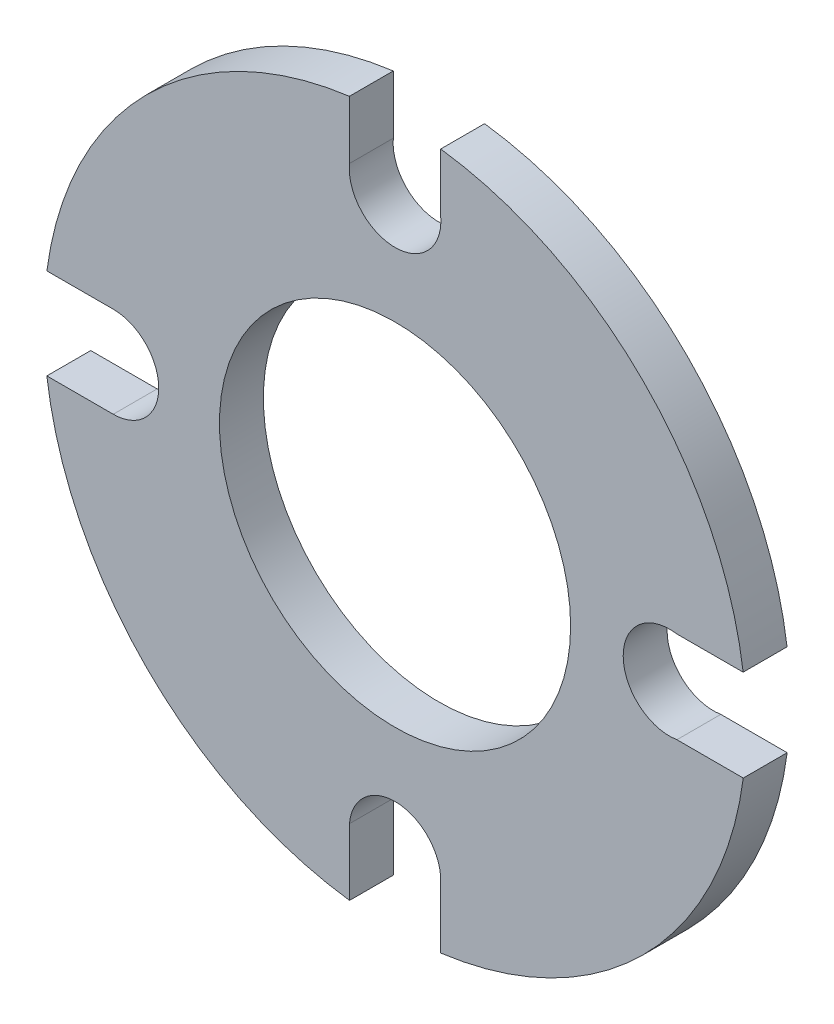
ISO-10303-21;
HEADER;
FILE_DESCRIPTION(('STEP AP214'),'2;1');
FILE_NAME('part.step','',(''),(''),'','','');
FILE_SCHEMA(('AUTOMOTIVE_DESIGN { 1 0 10303 214 1 1 1 1 }'));
ENDSEC;
DATA;
#1=APPLICATION_CONTEXT('core data for automotive mechanical design processes');
#2=APPLICATION_PROTOCOL_DEFINITION('international standard','automotive_design',2000,#1);
#3=PRODUCT_CONTEXT('',#1,'mechanical');
#4=PRODUCT('Part','Part','',(#3));
#5=PRODUCT_RELATED_PRODUCT_CATEGORY('part','',(#4));
#6=PRODUCT_DEFINITION_FORMATION('','',#4);
#7=PRODUCT_DEFINITION_CONTEXT('part definition',#1,'design');
#8=PRODUCT_DEFINITION('design','',#6,#7);
#9=PRODUCT_DEFINITION_SHAPE('','',#8);
#10=(LENGTH_UNIT() NAMED_UNIT(*) SI_UNIT(.MILLI.,.METRE.));
#11=(NAMED_UNIT(*) PLANE_ANGLE_UNIT() SI_UNIT($,.RADIAN.));
#12=(NAMED_UNIT(*) SI_UNIT($,.STERADIAN.) SOLID_ANGLE_UNIT());
#13=UNCERTAINTY_MEASURE_WITH_UNIT(LENGTH_MEASURE(1.E-05),#10,'distance_accuracy_value','');
#14=(GEOMETRIC_REPRESENTATION_CONTEXT(3) GLOBAL_UNCERTAINTY_ASSIGNED_CONTEXT((#13)) GLOBAL_UNIT_ASSIGNED_CONTEXT((#10,
#11,#12)) REPRESENTATION_CONTEXT('',''));
#15=CARTESIAN_POINT('',(0.,0.,0.));
#16=DIRECTION('',(0.,0.,1.));
#17=DIRECTION('',(1.,0.,0.));
#18=AXIS2_PLACEMENT_3D('',#15,#16,#17);
#19=CARTESIAN_POINT('',(-0.000815169605640896,-12.8964706457342,12.5));
#20=DIRECTION('',(6.32087356614961E-05,0.999999998002328,0.));
#21=DIRECTION('',(-0.999999998002328,6.32087356614961E-05,0.));
#22=AXIS2_PLACEMENT_3D('',#19,#20,#21);
#23=PLANE('',#22);
#24=DIRECTION('',(0.999999998002328,-6.32087356614961E-05,0.));
#25=VECTOR('',#24,1.);
#26=CARTESIAN_POINT('',(-0.000815169605640896,-12.8964706457342,0.));
#27=LINE('',#26,#25);
#28=CARTESIAN_POINT('',(-99.1657333863333,-12.8902025566192,0.));
#29=VERTEX_POINT('',#28);
#30=CARTESIAN_POINT('',(-80.2527401256116,-12.8913980230132,0.));
#31=VERTEX_POINT('',#30);
#32=EDGE_CURVE('E225',#29,#31,#27,.T.);
#33=ORIENTED_EDGE('',*,*,#32,.F.);
#34=DIRECTION('',(0.,0.,-1.));
#35=VECTOR('',#34,1.);
#36=CARTESIAN_POINT('',(-99.1657333863333,-12.8902025566192,12.5));
#37=LINE('',#36,#35);
#38=CARTESIAN_POINT('',(-99.1657333863333,-12.8902025566192,12.5));
#39=VERTEX_POINT('',#38);
#40=EDGE_CURVE('E11',#39,#29,#37,.T.);
#41=ORIENTED_EDGE('',*,*,#40,.F.);
#42=DIRECTION('',(0.999999998002328,-6.32087356614961E-05,0.));
#43=VECTOR('',#42,1.);
#44=CARTESIAN_POINT('',(-0.000815169605640896,-12.8964706457342,12.5));
#45=LINE('',#44,#43);
#46=CARTESIAN_POINT('',(-80.2527401256116,-12.8913980230132,12.5));
#47=VERTEX_POINT('',#46);
#48=EDGE_CURVE('E485',#39,#47,#45,.T.);
#49=ORIENTED_EDGE('',*,*,#48,.T.);
#50=DIRECTION('',(0.,0.,-1.));
#51=VECTOR('',#50,1.);
#52=CARTESIAN_POINT('',(-80.2527401256116,-12.8913980230132,12.5));
#53=LINE('',#52,#51);
#54=EDGE_CURVE('E60',#47,#31,#53,.T.);
#55=ORIENTED_EDGE('',*,*,#54,.T.);
#56=EDGE_LOOP('',(#33,#41,#49,#55));
#57=FACE_BOUND('',#56,.T.);
#58=ADVANCED_FACE('F43',(#57),#23,.T.);
#59=CARTESIAN_POINT('',(0.,0.,12.5));
#60=DIRECTION('',(0.,0.,-1.));
#61=DIRECTION('',(-1.,0.,0.));
#62=AXIS2_PLACEMENT_3D('',#59,#60,#61);
#63=CYLINDRICAL_SURFACE('',#62,100.);
#64=CARTESIAN_POINT('',(0.,0.,0.));
#65=DIRECTION('',(0.,0.,1.));
#66=DIRECTION('',(1.,0.,0.));
#67=AXIS2_PLACEMENT_3D('',#64,#65,#66);
#68=CIRCLE('',#67,100.);
#69=CARTESIAN_POINT('',(-12.9649431505709,-99.1559894766951,0.));
#70=VERTEX_POINT('',#69);
#71=EDGE_CURVE('E222',#29,#70,#68,.T.);
#72=ORIENTED_EDGE('',*,*,#71,.T.);
#73=DIRECTION('',(0.,0.,-1.));
#74=VECTOR('',#73,1.);
#75=CARTESIAN_POINT('',(-12.9649431505709,-99.1559894766951,12.5));
#76=LINE('',#75,#74);
#77=CARTESIAN_POINT('',(-12.9649431505709,-99.1559894766951,12.5));
#78=VERTEX_POINT('',#77);
#79=EDGE_CURVE('E52',#78,#70,#76,.T.);
#80=ORIENTED_EDGE('',*,*,#79,.F.);
#81=CARTESIAN_POINT('',(0.,0.,12.5));
#82=DIRECTION('',(0.,0.,1.));
#83=DIRECTION('',(1.,0.,0.));
#84=AXIS2_PLACEMENT_3D('',#81,#82,#83);
#85=CIRCLE('',#84,100.);
#86=EDGE_CURVE('E481',#39,#78,#85,.T.);
#87=ORIENTED_EDGE('',*,*,#86,.F.);
#88=ORIENTED_EDGE('',*,*,#40,.T.);
#89=EDGE_LOOP('',(#72,#80,#87,#88));
#90=FACE_BOUND('',#89,.T.);
#91=ADVANCED_FACE('F223',(#90),#63,.T.);
#92=CARTESIAN_POINT('',(-13.0665946672208,-0.0133972608107675,12.5));
#93=DIRECTION('',(0.99999947437399,0.00102530568292804,0.));
#94=DIRECTION('',(-0.00102530568292804,0.99999947437399,0.));
#95=AXIS2_PLACEMENT_3D('',#92,#93,#94);
#96=PLANE('',#95);
#97=DIRECTION('',(0.00102530568292804,-0.99999947437399,0.));
#98=VECTOR('',#97,1.);
#99=CARTESIAN_POINT('',(-13.0665946672208,-0.0133972608107675,0.));
#100=LINE('',#99,#98);
#101=CARTESIAN_POINT('',(-12.9843401339299,-80.2377551526905,0.));
#102=VERTEX_POINT('',#101);
#103=EDGE_CURVE('E216',#102,#70,#100,.T.);
#104=ORIENTED_EDGE('',*,*,#103,.F.);
#105=DIRECTION('',(0.,0.,-1.));
#106=VECTOR('',#105,1.);
#107=CARTESIAN_POINT('',(-12.9843401339299,-80.2377551526905,12.5));
#108=LINE('',#107,#106);
#109=CARTESIAN_POINT('',(-12.9843401339299,-80.2377551526905,12.5));
#110=VERTEX_POINT('',#109);
#111=EDGE_CURVE('E208',#110,#102,#108,.T.);
#112=ORIENTED_EDGE('',*,*,#111,.F.);
#113=DIRECTION('',(0.00102530568292804,-0.99999947437399,0.));
#114=VECTOR('',#113,1.);
#115=CARTESIAN_POINT('',(-13.0665946672208,-0.0133972608107675,12.5));
#116=LINE('',#115,#114);
#117=EDGE_CURVE('E219',#110,#78,#116,.T.);
#118=ORIENTED_EDGE('',*,*,#117,.T.);
#119=ORIENTED_EDGE('',*,*,#79,.T.);
#120=EDGE_LOOP('',(#104,#112,#118,#119));
#121=FACE_BOUND('',#120,.T.);
#122=ADVANCED_FACE('F214',(#121),#96,.T.);
#123=CARTESIAN_POINT('',(0.,-81.3,12.5));
#124=DIRECTION('',(0.,0.,-1.));
#125=DIRECTION('',(-1.,0.,0.));
#126=AXIS2_PLACEMENT_3D('',#123,#124,#125);
#127=CYLINDRICAL_SURFACE('',#126,13.0277186348653);
#128=CARTESIAN_POINT('',(0.,-81.3,0.));
#129=DIRECTION('',(0.,0.,1.));
#130=DIRECTION('',(1.,0.,0.));
#131=AXIS2_PLACEMENT_3D('',#128,#129,#130);
#132=CIRCLE('',#131,13.0277186348653);
#133=CARTESIAN_POINT('',(12.9858361253175,-80.2562026271266,0.));
#134=VERTEX_POINT('',#133);
#135=EDGE_CURVE('E230',#134,#102,#132,.T.);
#136=ORIENTED_EDGE('',*,*,#135,.F.);
#137=DIRECTION('',(0.,0.,-1.));
#138=VECTOR('',#137,1.);
#139=CARTESIAN_POINT('',(12.9858361253175,-80.2562026271266,12.5));
#140=LINE('',#139,#138);
#141=CARTESIAN_POINT('',(12.9858361253175,-80.2562026271266,12.5));
#142=VERTEX_POINT('',#141);
#143=EDGE_CURVE('E206',#142,#134,#140,.T.);
#144=ORIENTED_EDGE('',*,*,#143,.F.);
#145=CARTESIAN_POINT('',(0.,-81.3,12.5));
#146=DIRECTION('',(0.,0.,1.));
#147=DIRECTION('',(1.,0.,0.));
#148=AXIS2_PLACEMENT_3D('',#145,#146,#147);
#149=CIRCLE('',#148,13.0277186348653);
#150=EDGE_CURVE('E480',#142,#110,#149,.T.);
#151=ORIENTED_EDGE('',*,*,#150,.T.);
#152=ORIENTED_EDGE('',*,*,#111,.T.);
#153=EDGE_LOOP('',(#136,#144,#151,#152));
#154=FACE_BOUND('',#153,.T.);
#155=ADVANCED_FACE('F292',(#154),#127,.F.);
#156=CARTESIAN_POINT('',(12.9921721125097,-0.00102570624428404,12.5));
#157=DIRECTION('',(0.999999996883605,-7.89480182532311E-05,0.));
#158=DIRECTION('',(7.89480182532311E-05,0.999999996883605,0.));
#159=AXIS2_PLACEMENT_3D('',#156,#157,#158);
#160=PLANE('',#159);
#161=DIRECTION('',(-7.89480182532311E-05,-0.999999996883605,0.));
#162=VECTOR('',#161,1.);
#163=CARTESIAN_POINT('',(12.9921721125097,-0.00102570624428404,0.));
#164=LINE('',#163,#162);
#165=CARTESIAN_POINT('',(12.9843442250193,-99.1534507974695,0.));
#166=VERTEX_POINT('',#165);
#167=EDGE_CURVE('E232',#134,#166,#164,.T.);
#168=ORIENTED_EDGE('',*,*,#167,.T.);
#169=DIRECTION('',(0.,0.,-1.));
#170=VECTOR('',#169,1.);
#171=CARTESIAN_POINT('',(12.9843442250193,-99.1534507974695,12.5));
#172=LINE('',#171,#170);
#173=CARTESIAN_POINT('',(12.9843442250193,-99.1534507974695,12.5));
#174=VERTEX_POINT('',#173);
#175=EDGE_CURVE('E203',#174,#166,#172,.T.);
#176=ORIENTED_EDGE('',*,*,#175,.F.);
#177=DIRECTION('',(-7.89480182532311E-05,-0.999999996883605,0.));
#178=VECTOR('',#177,1.);
#179=CARTESIAN_POINT('',(12.9921721125097,-0.00102570624428404,12.5));
#180=LINE('',#179,#178);
#181=EDGE_CURVE('E483',#142,#174,#180,.T.);
#182=ORIENTED_EDGE('',*,*,#181,.F.);
#183=ORIENTED_EDGE('',*,*,#143,.T.);
#184=EDGE_LOOP('',(#168,#176,#182,#183));
#185=FACE_BOUND('',#184,.T.);
#186=ADVANCED_FACE('F295',(#185),#160,.F.);
#187=CARTESIAN_POINT('',(0.,0.,12.5));
#188=DIRECTION('',(0.,0.,-1.));
#189=DIRECTION('',(-1.,0.,0.));
#190=AXIS2_PLACEMENT_3D('',#187,#188,#189);
#191=CYLINDRICAL_SURFACE('',#190,100.);
#192=CARTESIAN_POINT('',(0.,0.,0.));
#193=DIRECTION('',(0.,0.,1.));
#194=DIRECTION('',(1.,0.,0.));
#195=AXIS2_PLACEMENT_3D('',#192,#193,#194);
#196=CIRCLE('',#195,100.);
#197=CARTESIAN_POINT('',(99.164103047122,-12.9027387348491,0.));
#198=VERTEX_POINT('',#197);
#199=EDGE_CURVE('E238',#166,#198,#196,.T.);
#200=ORIENTED_EDGE('',*,*,#199,.T.);
#201=DIRECTION('',(0.,0.,-1.));
#202=VECTOR('',#201,1.);
#203=CARTESIAN_POINT('',(99.164103047122,-12.9027387348491,12.5));
#204=LINE('',#203,#202);
#205=CARTESIAN_POINT('',(99.164103047122,-12.9027387348491,12.5));
#206=VERTEX_POINT('',#205);
#207=EDGE_CURVE('E201',#206,#198,#204,.T.);
#208=ORIENTED_EDGE('',*,*,#207,.F.);
#209=CARTESIAN_POINT('',(0.,0.,12.5));
#210=DIRECTION('',(0.,0.,1.));
#211=DIRECTION('',(1.,0.,0.));
#212=AXIS2_PLACEMENT_3D('',#209,#210,#211);
#213=CIRCLE('',#212,100.);
#214=EDGE_CURVE('E475',#174,#206,#213,.T.);
#215=ORIENTED_EDGE('',*,*,#214,.F.);
#216=ORIENTED_EDGE('',*,*,#175,.T.);
#217=EDGE_LOOP('',(#200,#208,#215,#216));
#218=FACE_BOUND('',#217,.T.);
#219=ADVANCED_FACE('F299',(#218),#191,.T.);
#220=CARTESIAN_POINT('',(-0.000815169605639287,-12.8964706457342,12.5));
#221=DIRECTION('',(6.32087356613713E-05,0.999999998002328,0.));
#222=DIRECTION('',(-0.999999998002328,6.32087356613713E-05,0.));
#223=AXIS2_PLACEMENT_3D('',#220,#221,#222);
#224=PLANE('',#223);
#225=DIRECTION('',(0.999999998002328,-6.32087356613713E-05,0.));
#226=VECTOR('',#225,1.);
#227=CARTESIAN_POINT('',(-0.000815169605639287,-12.8964706457342,0.));
#228=LINE('',#227,#226);
#229=CARTESIAN_POINT('',(80.269796005816,-12.9015444495875,0.));
#230=VERTEX_POINT('',#229);
#231=EDGE_CURVE('E241',#230,#198,#228,.T.);
#232=ORIENTED_EDGE('',*,*,#231,.F.);
#233=DIRECTION('',(0.,0.,-1.));
#234=VECTOR('',#233,1.);
#235=CARTESIAN_POINT('',(80.269796005816,-12.9015444495875,12.5));
#236=LINE('',#235,#234);
#237=CARTESIAN_POINT('',(80.269796005816,-12.9015444495875,12.5));
#238=VERTEX_POINT('',#237);
#239=EDGE_CURVE('E199',#238,#230,#236,.T.);
#240=ORIENTED_EDGE('',*,*,#239,.F.);
#241=DIRECTION('',(0.999999998002328,-6.32087356613713E-05,0.));
#242=VECTOR('',#241,1.);
#243=CARTESIAN_POINT('',(-0.000815169605639287,-12.8964706457342,12.5));
#244=LINE('',#243,#242);
#245=EDGE_CURVE('E473',#238,#206,#244,.T.);
#246=ORIENTED_EDGE('',*,*,#245,.T.);
#247=ORIENTED_EDGE('',*,*,#207,.T.);
#248=EDGE_LOOP('',(#232,#240,#246,#247));
#249=FACE_BOUND('',#248,.T.);
#250=ADVANCED_FACE('F303',(#249),#224,.T.);
#251=CARTESIAN_POINT('',(78.1669565961171,0.128201757810213,12.5));
#252=DIRECTION('',(0.,0.,-1.));
#253=DIRECTION('',(-1.,0.,0.));
#254=AXIS2_PLACEMENT_3D('',#251,#252,#253);
#255=CYLINDRICAL_SURFACE('',#254,13.1983415553689);
#256=CARTESIAN_POINT('',(78.1669565961171,0.128201757810213,0.));
#257=DIRECTION('',(0.,0.,1.));
#258=DIRECTION('',(1.,0.,0.));
#259=AXIS2_PLACEMENT_3D('',#256,#257,#258);
#260=CIRCLE('',#259,13.1983415553689);
#261=CARTESIAN_POINT('',(80.2270445902029,13.1647755894886,0.));
#262=VERTEX_POINT('',#261);
#263=EDGE_CURVE('E244',#262,#230,#260,.T.);
#264=ORIENTED_EDGE('',*,*,#263,.F.);
#265=DIRECTION('',(0.,0.,-1.));
#266=VECTOR('',#265,1.);
#267=CARTESIAN_POINT('',(80.2270445902029,13.1647755894886,12.5));
#268=LINE('',#267,#266);
#269=CARTESIAN_POINT('',(80.2270445902029,13.1647755894886,12.5));
#270=VERTEX_POINT('',#269);
#271=EDGE_CURVE('E197',#270,#262,#268,.T.);
#272=ORIENTED_EDGE('',*,*,#271,.F.);
#273=CARTESIAN_POINT('',(78.1669565961171,0.128201757810213,12.5));
#274=DIRECTION('',(0.,0.,1.));
#275=DIRECTION('',(1.,0.,0.));
#276=AXIS2_PLACEMENT_3D('',#273,#274,#275);
#277=CIRCLE('',#276,13.1983415553689);
#278=EDGE_CURVE('E468',#270,#238,#277,.T.);
#279=ORIENTED_EDGE('',*,*,#278,.T.);
#280=ORIENTED_EDGE('',*,*,#239,.T.);
#281=EDGE_LOOP('',(#264,#272,#279,#280));
#282=FACE_BOUND('',#281,.T.);
#283=ADVANCED_FACE('F307',(#282),#255,.F.);
#284=CARTESIAN_POINT('',(-0.0120289391300913,13.0910465005806,12.5));
#285=DIRECTION('',(-0.000918867261791298,0.999999577841389,0.));
#286=DIRECTION('',(-0.999999577841389,-0.000918867261791298,0.));
#287=AXIS2_PLACEMENT_3D('',#284,#285,#286);
#288=PLANE('',#287);
#289=DIRECTION('',(0.999999577841389,0.000918867261791298,0.));
#290=VECTOR('',#289,1.);
#291=CARTESIAN_POINT('',(-0.0120289391300913,13.0910465005806,0.));
#292=LINE('',#291,#290);
#293=CARTESIAN_POINT('',(99.127347992285,13.1821424668542,0.));
#294=VERTEX_POINT('',#293);
#295=EDGE_CURVE('E247',#262,#294,#292,.T.);
#296=ORIENTED_EDGE('',*,*,#295,.T.);
#297=DIRECTION('',(0.,0.,-1.));
#298=VECTOR('',#297,1.);
#299=CARTESIAN_POINT('',(99.127347992285,13.1821424668542,12.5));
#300=LINE('',#299,#298);
#301=CARTESIAN_POINT('',(99.127347992285,13.1821424668542,12.5));
#302=VERTEX_POINT('',#301);
#303=EDGE_CURVE('E194',#302,#294,#300,.T.);
#304=ORIENTED_EDGE('',*,*,#303,.F.);
#305=DIRECTION('',(0.999999577841389,0.000918867261791298,0.));
#306=VECTOR('',#305,1.);
#307=CARTESIAN_POINT('',(-0.0120289391300913,13.0910465005806,12.5));
#308=LINE('',#307,#306);
#309=EDGE_CURVE('E465',#270,#302,#308,.T.);
#310=ORIENTED_EDGE('',*,*,#309,.F.);
#311=ORIENTED_EDGE('',*,*,#271,.T.);
#312=EDGE_LOOP('',(#296,#304,#310,#311));
#313=FACE_BOUND('',#312,.T.);
#314=ADVANCED_FACE('F311',(#313),#288,.F.);
#315=CARTESIAN_POINT('',(0.,0.,12.5));
#316=DIRECTION('',(0.,0.,-1.));
#317=DIRECTION('',(-1.,0.,0.));
#318=AXIS2_PLACEMENT_3D('',#315,#316,#317);
#319=CYLINDRICAL_SURFACE('',#318,100.);
#320=CARTESIAN_POINT('',(0.,0.,0.));
#321=DIRECTION('',(0.,0.,1.));
#322=DIRECTION('',(1.,0.,0.));
#323=AXIS2_PLACEMENT_3D('',#320,#321,#322);
#324=CIRCLE('',#323,100.);
#325=CARTESIAN_POINT('',(13.,99.1513993849809,0.));
#326=VERTEX_POINT('',#325);
#327=EDGE_CURVE('E250',#294,#326,#324,.T.);
#328=ORIENTED_EDGE('',*,*,#327,.T.);
#329=DIRECTION('',(0.,0.,-1.));
#330=VECTOR('',#329,1.);
#331=CARTESIAN_POINT('',(13.,99.1513993849809,12.5));
#332=LINE('',#331,#330);
#333=CARTESIAN_POINT('',(13.,99.1513993849809,12.5));
#334=VERTEX_POINT('',#333);
#335=EDGE_CURVE('E191',#334,#326,#332,.T.);
#336=ORIENTED_EDGE('',*,*,#335,.F.);
#337=CARTESIAN_POINT('',(0.,0.,12.5));
#338=DIRECTION('',(0.,0.,1.));
#339=DIRECTION('',(1.,0.,0.));
#340=AXIS2_PLACEMENT_3D('',#337,#338,#339);
#341=CIRCLE('',#340,100.);
#342=EDGE_CURVE('E462',#302,#334,#341,.T.);
#343=ORIENTED_EDGE('',*,*,#342,.F.);
#344=ORIENTED_EDGE('',*,*,#303,.T.);
#345=EDGE_LOOP('',(#328,#336,#343,#344));
#346=FACE_BOUND('',#345,.T.);
#347=ADVANCED_FACE('F315',(#346),#319,.T.);
#348=CARTESIAN_POINT('',(12.9921721125097,-0.00102570624428046,12.5));
#349=DIRECTION('',(0.999999996883605,-7.89480182529557E-05,0.));
#350=DIRECTION('',(7.89480182529557E-05,0.999999996883605,0.));
#351=AXIS2_PLACEMENT_3D('',#348,#349,#350);
#352=PLANE('',#351);
#353=DIRECTION('',(-7.89480182529557E-05,-0.999999996883605,0.));
#354=VECTOR('',#353,1.);
#355=CARTESIAN_POINT('',(12.9921721125097,-0.00102570624428046,0.));
#356=LINE('',#355,#354);
#357=CARTESIAN_POINT('',(12.9986920281371,82.583892210087,0.));
#358=VERTEX_POINT('',#357);
#359=EDGE_CURVE('E253',#326,#358,#356,.T.);
#360=ORIENTED_EDGE('',*,*,#359,.T.);
#361=DIRECTION('',(0.,0.,-1.));
#362=VECTOR('',#361,1.);
#363=CARTESIAN_POINT('',(12.9986920281371,82.583892210087,12.5));
#364=LINE('',#363,#362);
#365=CARTESIAN_POINT('',(12.9986920281371,82.583892210087,12.5));
#366=VERTEX_POINT('',#365);
#367=EDGE_CURVE('E189',#366,#358,#364,.T.);
#368=ORIENTED_EDGE('',*,*,#367,.F.);
#369=DIRECTION('',(-7.89480182529557E-05,-0.999999996883605,0.));
#370=VECTOR('',#369,1.);
#371=CARTESIAN_POINT('',(12.9921721125097,-0.00102570624428046,12.5));
#372=LINE('',#371,#370);
#373=EDGE_CURVE('E495',#334,#366,#372,.T.);
#374=ORIENTED_EDGE('',*,*,#373,.F.);
#375=ORIENTED_EDGE('',*,*,#335,.T.);
#376=EDGE_LOOP('',(#360,#368,#374,#375));
#377=FACE_BOUND('',#376,.T.);
#378=ADVANCED_FACE('F319',(#377),#352,.F.);
#379=CARTESIAN_POINT('',(0.,81.4116035017761,12.5));
#380=DIRECTION('',(0.,0.,-1.));
#381=DIRECTION('',(-1.,0.,0.));
#382=AXIS2_PLACEMENT_3D('',#379,#380,#381);
#383=CYLINDRICAL_SURFACE('',#382,13.0514464814436);
#384=CARTESIAN_POINT('',(0.,81.4116035017761,0.));
#385=DIRECTION('',(0.,0.,1.));
#386=DIRECTION('',(1.,0.,0.));
#387=AXIS2_PLACEMENT_3D('',#384,#385,#386);
#388=CIRCLE('',#387,13.0514464814436);
#389=CARTESIAN_POINT('',(-13.,82.5692974414629,0.));
#390=VERTEX_POINT('',#389);
#391=EDGE_CURVE('E256',#390,#358,#388,.T.);
#392=ORIENTED_EDGE('',*,*,#391,.F.);
#393=DIRECTION('',(0.,0.,-1.));
#394=VECTOR('',#393,1.);
#395=CARTESIAN_POINT('',(-13.,82.5692974414629,12.5));
#396=LINE('',#395,#394);
#397=CARTESIAN_POINT('',(-13.,82.5692974414629,12.5));
#398=VERTEX_POINT('',#397);
#399=EDGE_CURVE('E183',#398,#390,#396,.T.);
#400=ORIENTED_EDGE('',*,*,#399,.F.);
#401=CARTESIAN_POINT('',(0.,81.4116035017761,12.5));
#402=DIRECTION('',(0.,0.,1.));
#403=DIRECTION('',(1.,0.,0.));
#404=AXIS2_PLACEMENT_3D('',#401,#402,#403);
#405=CIRCLE('',#404,13.0514464814436);
#406=EDGE_CURVE('E456',#398,#366,#405,.T.);
#407=ORIENTED_EDGE('',*,*,#406,.T.);
#408=ORIENTED_EDGE('',*,*,#367,.T.);
#409=EDGE_LOOP('',(#392,#400,#407,#408));
#410=FACE_BOUND('',#409,.T.);
#411=ADVANCED_FACE('F323',(#410),#383,.F.);
#412=CARTESIAN_POINT('',(-13.,0.,12.5));
#413=DIRECTION('',(-1.,0.,0.));
#414=DIRECTION('',(0.,0.,1.));
#415=AXIS2_PLACEMENT_3D('',#412,#413,#414);
#416=PLANE('',#415);
#417=DIRECTION('',(0.,1.,0.));
#418=VECTOR('',#417,1.);
#419=CARTESIAN_POINT('',(-13.,0.,0.));
#420=LINE('',#419,#418);
#421=CARTESIAN_POINT('',(-13.,99.1513993849809,0.));
#422=VERTEX_POINT('',#421);
#423=EDGE_CURVE('E259',#390,#422,#420,.T.);
#424=ORIENTED_EDGE('',*,*,#423,.T.);
#425=DIRECTION('',(0.,0.,-1.));
#426=VECTOR('',#425,1.);
#427=CARTESIAN_POINT('',(-13.,99.1513993849809,12.5));
#428=LINE('',#427,#426);
#429=CARTESIAN_POINT('',(-13.,99.1513993849809,12.5));
#430=VERTEX_POINT('',#429);
#431=EDGE_CURVE('E181',#430,#422,#428,.T.);
#432=ORIENTED_EDGE('',*,*,#431,.F.);
#433=DIRECTION('',(0.,1.,0.));
#434=VECTOR('',#433,1.);
#435=CARTESIAN_POINT('',(-13.,0.,12.5));
#436=LINE('',#435,#434);
#437=EDGE_CURVE('E174',#398,#430,#436,.T.);
#438=ORIENTED_EDGE('',*,*,#437,.F.);
#439=ORIENTED_EDGE('',*,*,#399,.T.);
#440=EDGE_LOOP('',(#424,#432,#438,#439));
#441=FACE_BOUND('',#440,.T.);
#442=ADVANCED_FACE('F327',(#441),#416,.F.);
#443=CARTESIAN_POINT('',(0.,0.,12.5));
#444=DIRECTION('',(0.,0.,-1.));
#445=DIRECTION('',(-1.,0.,0.));
#446=AXIS2_PLACEMENT_3D('',#443,#444,#445);
#447=CYLINDRICAL_SURFACE('',#446,100.);
#448=CARTESIAN_POINT('',(0.,0.,0.));
#449=DIRECTION('',(0.,0.,1.));
#450=DIRECTION('',(1.,0.,0.));
#451=AXIS2_PLACEMENT_3D('',#448,#449,#450);
#452=CIRCLE('',#451,100.);
#453=CARTESIAN_POINT('',(-99.1514058705451,12.999950534307,0.));
#454=VERTEX_POINT('',#453);
#455=EDGE_CURVE('E180',#422,#454,#452,.T.);
#456=ORIENTED_EDGE('',*,*,#455,.T.);
#457=DIRECTION('',(0.,0.,-1.));
#458=VECTOR('',#457,1.);
#459=CARTESIAN_POINT('',(-99.1514058705451,12.999950534307,12.5));
#460=LINE('',#459,#458);
#461=CARTESIAN_POINT('',(-99.1514058705451,12.999950534307,12.5));
#462=VERTEX_POINT('',#461);
#463=EDGE_CURVE('E162',#462,#454,#460,.T.);
#464=ORIENTED_EDGE('',*,*,#463,.F.);
#465=CARTESIAN_POINT('',(0.,0.,12.5));
#466=DIRECTION('',(0.,0.,1.));
#467=DIRECTION('',(1.,0.,0.));
#468=AXIS2_PLACEMENT_3D('',#465,#466,#467);
#469=CIRCLE('',#468,100.);
#470=EDGE_CURVE('E167',#430,#462,#469,.T.);
#471=ORIENTED_EDGE('',*,*,#470,.F.);
#472=ORIENTED_EDGE('',*,*,#431,.T.);
#473=EDGE_LOOP('',(#456,#464,#471,#472));
#474=FACE_BOUND('',#473,.T.);
#475=ADVANCED_FACE('F179',(#474),#447,.T.);
#476=CARTESIAN_POINT('',(-0.0120289391300889,13.0910465005806,12.5));
#477=DIRECTION('',(-0.000918867261791114,0.999999577841389,0.));
#478=DIRECTION('',(-0.999999577841389,-0.000918867261791114,0.));
#479=AXIS2_PLACEMENT_3D('',#476,#477,#478);
#480=PLANE('',#479);
#481=DIRECTION('',(0.999999577841389,0.000918867261791114,0.));
#482=VECTOR('',#481,1.);
#483=CARTESIAN_POINT('',(-0.0120289391300889,13.0910465005806,0.));
#484=LINE('',#483,#482);
#485=CARTESIAN_POINT('',(-80.2511024684631,13.0173174116727,0.));
#486=VERTEX_POINT('',#485);
#487=EDGE_CURVE('E263',#454,#486,#484,.T.);
#488=ORIENTED_EDGE('',*,*,#487,.T.);
#489=DIRECTION('',(0.,0.,-1.));
#490=VECTOR('',#489,1.);
#491=CARTESIAN_POINT('',(-80.2511024684631,13.0173174116727,12.5));
#492=LINE('',#491,#490);
#493=CARTESIAN_POINT('',(-80.2511024684631,13.0173174116727,12.5));
#494=VERTEX_POINT('',#493);
#495=EDGE_CURVE('E110',#494,#486,#492,.T.);
#496=ORIENTED_EDGE('',*,*,#495,.F.);
#497=DIRECTION('',(0.999999577841389,0.000918867261791114,0.));
#498=VECTOR('',#497,1.);
#499=CARTESIAN_POINT('',(-0.0120289391300889,13.0910465005806,12.5));
#500=LINE('',#499,#498);
#501=EDGE_CURVE('E158',#462,#494,#500,.T.);
#502=ORIENTED_EDGE('',*,*,#501,.F.);
#503=ORIENTED_EDGE('',*,*,#463,.T.);
#504=EDGE_LOOP('',(#488,#496,#502,#503));
#505=FACE_BOUND('',#504,.T.);
#506=ADVANCED_FACE('F160',(#505),#480,.F.);
#507=CARTESIAN_POINT('',(0.,0.,12.5));
#508=DIRECTION('',(0.,0.,-1.));
#509=DIRECTION('',(-1.,0.,0.));
#510=AXIS2_PLACEMENT_3D('',#507,#508,#509);
#511=CYLINDRICAL_SURFACE('',#510,50.);
#512=CARTESIAN_POINT('',(0.,0.,12.5));
#513=DIRECTION('',(0.,0.,1.));
#514=DIRECTION('',(1.,0.,0.));
#515=AXIS2_PLACEMENT_3D('',#512,#513,#514);
#516=CIRCLE('',#515,50.);
#517=CARTESIAN_POINT('',(50.,0.,12.5));
#518=VERTEX_POINT('',#517);
#519=EDGE_CURVE('E267',#518,#518,#516,.T.);
#520=ORIENTED_EDGE('',*,*,#519,.T.);
#521=EDGE_LOOP('',(#520));
#522=FACE_BOUND('',#521,.T.);
#523=CARTESIAN_POINT('',(0.,0.,0.));
#524=DIRECTION('',(0.,0.,1.));
#525=DIRECTION('',(1.,0.,0.));
#526=AXIS2_PLACEMENT_3D('',#523,#524,#525);
#527=CIRCLE('',#526,50.);
#528=CARTESIAN_POINT('',(50.,0.,0.));
#529=VERTEX_POINT('',#528);
#530=EDGE_CURVE('E270',#529,#529,#527,.T.);
#531=ORIENTED_EDGE('',*,*,#530,.F.);
#532=EDGE_LOOP('',(#531));
#533=FACE_BOUND('',#532,.T.);
#534=ADVANCED_FACE('F45',(#522,#533),#511,.F.);
#535=CARTESIAN_POINT('',(-80.2519212970373,0.0629596943297513,12.5));
#536=DIRECTION('',(0.,0.,-1.));
#537=DIRECTION('',(-1.,0.,0.));
#538=AXIS2_PLACEMENT_3D('',#535,#536,#537);
#539=CYLINDRICAL_SURFACE('',#538,12.9543577432215);
#540=CARTESIAN_POINT('',(-80.2519212970373,0.0629596943297513,0.));
#541=DIRECTION('',(0.,0.,1.));
#542=DIRECTION('',(1.,0.,0.));
#543=AXIS2_PLACEMENT_3D('',#540,#541,#542);
#544=CIRCLE('',#543,12.9543577432215);
#545=EDGE_CURVE('E265',#31,#486,#544,.T.);
#546=ORIENTED_EDGE('',*,*,#545,.F.);
#547=ORIENTED_EDGE('',*,*,#54,.F.);
#548=CARTESIAN_POINT('',(-80.2519212970373,0.0629596943297513,12.5));
#549=DIRECTION('',(0.,0.,1.));
#550=DIRECTION('',(1.,0.,0.));
#551=AXIS2_PLACEMENT_3D('',#548,#549,#550);
#552=CIRCLE('',#551,12.9543577432215);
#553=EDGE_CURVE('E166',#47,#494,#552,.T.);
#554=ORIENTED_EDGE('',*,*,#553,.T.);
#555=ORIENTED_EDGE('',*,*,#495,.T.);
#556=EDGE_LOOP('',(#546,#547,#554,#555));
#557=FACE_BOUND('',#556,.T.);
#558=ADVANCED_FACE('F272',(#557),#539,.F.);
#559=CARTESIAN_POINT('',(0.,0.,12.5));
#560=DIRECTION('',(0.,0.,1.));
#561=DIRECTION('',(1.,0.,0.));
#562=AXIS2_PLACEMENT_3D('',#559,#560,#561);
#563=PLANE('',#562);
#564=ORIENTED_EDGE('',*,*,#519,.F.);
#565=EDGE_LOOP('',(#564));
#566=FACE_BOUND('',#565,.T.);
#567=ORIENTED_EDGE('',*,*,#48,.F.);
#568=ORIENTED_EDGE('',*,*,#86,.T.);
#569=ORIENTED_EDGE('',*,*,#117,.F.);
#570=ORIENTED_EDGE('',*,*,#150,.F.);
#571=ORIENTED_EDGE('',*,*,#181,.T.);
#572=ORIENTED_EDGE('',*,*,#214,.T.);
#573=ORIENTED_EDGE('',*,*,#245,.F.);
#574=ORIENTED_EDGE('',*,*,#278,.F.);
#575=ORIENTED_EDGE('',*,*,#309,.T.);
#576=ORIENTED_EDGE('',*,*,#342,.T.);
#577=ORIENTED_EDGE('',*,*,#373,.T.);
#578=ORIENTED_EDGE('',*,*,#406,.F.);
#579=ORIENTED_EDGE('',*,*,#437,.T.);
#580=ORIENTED_EDGE('',*,*,#470,.T.);
#581=ORIENTED_EDGE('',*,*,#501,.T.);
#582=ORIENTED_EDGE('',*,*,#553,.F.);
#583=EDGE_LOOP('',(#567,#568,#569,#570,#571,#572,#573,#574,#575,#576,#577,#578,#579,#580,#581,#582));
#584=FACE_BOUND('',#583,.T.);
#585=ADVANCED_FACE('F171',(#566,#584),#563,.T.);
#586=CARTESIAN_POINT('',(0.,0.,0.));
#587=DIRECTION('',(0.,0.,1.));
#588=DIRECTION('',(1.,0.,0.));
#589=AXIS2_PLACEMENT_3D('',#586,#587,#588);
#590=PLANE('',#589);
#591=ORIENTED_EDGE('',*,*,#530,.T.);
#592=EDGE_LOOP('',(#591));
#593=FACE_BOUND('',#592,.T.);
#594=ORIENTED_EDGE('',*,*,#32,.T.);
#595=ORIENTED_EDGE('',*,*,#545,.T.);
#596=ORIENTED_EDGE('',*,*,#487,.F.);
#597=ORIENTED_EDGE('',*,*,#455,.F.);
#598=ORIENTED_EDGE('',*,*,#423,.F.);
#599=ORIENTED_EDGE('',*,*,#391,.T.);
#600=ORIENTED_EDGE('',*,*,#359,.F.);
#601=ORIENTED_EDGE('',*,*,#327,.F.);
#602=ORIENTED_EDGE('',*,*,#295,.F.);
#603=ORIENTED_EDGE('',*,*,#263,.T.);
#604=ORIENTED_EDGE('',*,*,#231,.T.);
#605=ORIENTED_EDGE('',*,*,#199,.F.);
#606=ORIENTED_EDGE('',*,*,#167,.F.);
#607=ORIENTED_EDGE('',*,*,#135,.T.);
#608=ORIENTED_EDGE('',*,*,#103,.T.);
#609=ORIENTED_EDGE('',*,*,#71,.F.);
#610=EDGE_LOOP('',(#594,#595,#596,#597,#598,#599,#600,#601,#602,#603,#604,#605,#606,#607,#608,#609));
#611=FACE_BOUND('',#610,.T.);
#612=ADVANCED_FACE('F227',(#593,#611),#590,.F.);
#613=CLOSED_SHELL('',(#58,#91,#122,#155,#186,#219,#250,#283,#314,#347,#378,#411,#442,#475,#506,
#534,#558,#585,#612));
#614=MANIFOLD_SOLID_BREP('B2',#613);
#615=ADVANCED_BREP_SHAPE_REPRESENTATION('',(#18,#614),#14);
#616=SHAPE_DEFINITION_REPRESENTATION(#9,#615);
ENDSEC;
END-ISO-10303-21;
